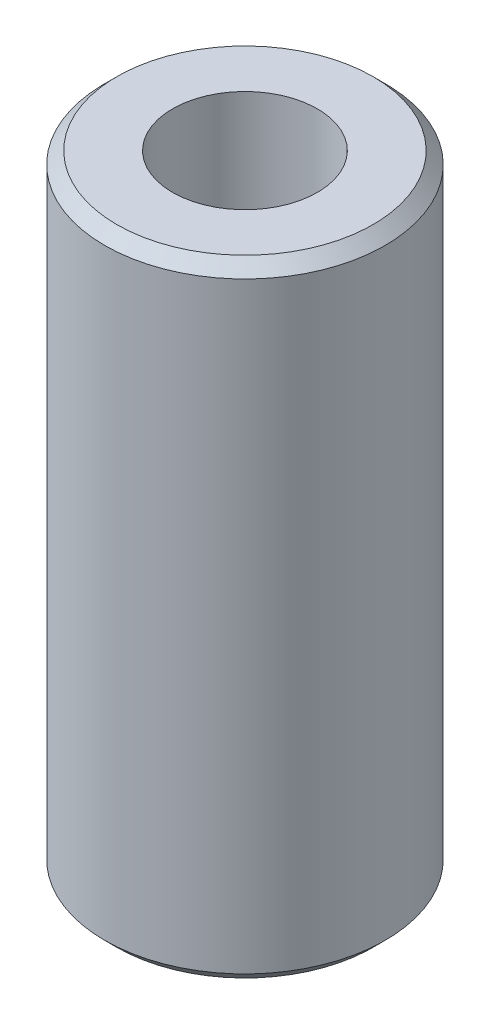
ISO-10303-21;
HEADER;
FILE_DESCRIPTION(('STEP AP214'),'2;1');
FILE_NAME('part.step','',(''),(''),'','','');
FILE_SCHEMA(('AUTOMOTIVE_DESIGN { 1 0 10303 214 1 1 1 1 }'));
ENDSEC;
DATA;
#1=APPLICATION_CONTEXT('core data for automotive mechanical design processes');
#2=APPLICATION_PROTOCOL_DEFINITION('international standard','automotive_design',2000,#1);
#3=PRODUCT_CONTEXT('',#1,'mechanical');
#4=PRODUCT('Part','Part','',(#3));
#5=PRODUCT_RELATED_PRODUCT_CATEGORY('part','',(#4));
#6=PRODUCT_DEFINITION_FORMATION('','',#4);
#7=PRODUCT_DEFINITION_CONTEXT('part definition',#1,'design');
#8=PRODUCT_DEFINITION('design','',#6,#7);
#9=PRODUCT_DEFINITION_SHAPE('','',#8);
#10=(LENGTH_UNIT() NAMED_UNIT(*) SI_UNIT(.MILLI.,.METRE.));
#11=(NAMED_UNIT(*) PLANE_ANGLE_UNIT() SI_UNIT($,.RADIAN.));
#12=(NAMED_UNIT(*) SI_UNIT($,.STERADIAN.) SOLID_ANGLE_UNIT());
#13=UNCERTAINTY_MEASURE_WITH_UNIT(LENGTH_MEASURE(1.E-05),#10,'distance_accuracy_value','');
#14=(GEOMETRIC_REPRESENTATION_CONTEXT(3) GLOBAL_UNCERTAINTY_ASSIGNED_CONTEXT((#13)) GLOBAL_UNIT_ASSIGNED_CONTEXT((#10,
#11,#12)) REPRESENTATION_CONTEXT('',''));
#15=CARTESIAN_POINT('',(0.,0.,0.));
#16=DIRECTION('',(0.,0.,1.));
#17=DIRECTION('',(1.,0.,0.));
#18=AXIS2_PLACEMENT_3D('',#15,#16,#17);
#19=CARTESIAN_POINT('',(0.,111.609927978686,0.));
#20=DIRECTION('',(0.,-1.,0.));
#21=DIRECTION('',(0.,0.,-1.));
#22=AXIS2_PLACEMENT_3D('',#19,#20,#21);
#23=CYLINDRICAL_SURFACE('',#22,25.);
#24=CARTESIAN_POINT('',(0.,109.460376625235,0.));
#25=DIRECTION('',(0.,1.,0.));
#26=DIRECTION('',(0.,0.,1.));
#27=AXIS2_PLACEMENT_3D('',#24,#25,#26);
#28=CIRCLE('',#27,25.);
#29=CARTESIAN_POINT('',(0.,109.460376625235,25.));
#30=VERTEX_POINT('',#29);
#31=EDGE_CURVE('E50',#30,#30,#28,.F.);
#32=ORIENTED_EDGE('',*,*,#31,.T.);
#33=EDGE_LOOP('',(#32));
#34=FACE_BOUND('',#33,.T.);
#35=CARTESIAN_POINT('',(0.,2.14955135345062,0.));
#36=DIRECTION('',(0.,1.,0.));
#37=DIRECTION('',(0.,0.,1.));
#38=AXIS2_PLACEMENT_3D('',#35,#36,#37);
#39=CIRCLE('',#38,25.);
#40=CARTESIAN_POINT('',(0.,2.14955135345062,25.));
#41=VERTEX_POINT('',#40);
#42=EDGE_CURVE('E51',#41,#41,#39,.T.);
#43=ORIENTED_EDGE('',*,*,#42,.T.);
#44=EDGE_LOOP('',(#43));
#45=FACE_BOUND('',#44,.T.);
#46=ADVANCED_FACE('F39',(#34,#45),#23,.T.);
#47=CARTESIAN_POINT('',(0.,111.609927978686,0.));
#48=DIRECTION('',(0.,1.,0.));
#49=DIRECTION('',(0.,0.,1.));
#50=AXIS2_PLACEMENT_3D('',#47,#48,#49);
#51=PLANE('',#50);
#52=CARTESIAN_POINT('',(0.,111.609927978686,0.));
#53=DIRECTION('',(0.,1.,0.));
#54=DIRECTION('',(0.,0.,1.));
#55=AXIS2_PLACEMENT_3D('',#52,#53,#54);
#56=CIRCLE('',#55,22.8504486465494);
#57=CARTESIAN_POINT('',(0.,111.609927978686,22.8504486465494));
#58=VERTEX_POINT('',#57);
#59=EDGE_CURVE('E54',#58,#58,#56,.T.);
#60=ORIENTED_EDGE('',*,*,#59,.T.);
#61=EDGE_LOOP('',(#60));
#62=FACE_BOUND('',#61,.T.);
#63=CARTESIAN_POINT('',(0.,111.609927978686,0.));
#64=DIRECTION('',(0.,1.,0.));
#65=DIRECTION('',(0.,0.,1.));
#66=AXIS2_PLACEMENT_3D('',#63,#64,#65);
#67=CIRCLE('',#66,12.9145364694436);
#68=CARTESIAN_POINT('',(0.,111.609927978686,12.9145364694436));
#69=VERTEX_POINT('',#68);
#70=EDGE_CURVE('E58',#69,#69,#67,.T.);
#71=ORIENTED_EDGE('',*,*,#70,.F.);
#72=EDGE_LOOP('',(#71));
#73=FACE_BOUND('',#72,.T.);
#74=ADVANCED_FACE('F69',(#62,#73),#51,.T.);
#75=CARTESIAN_POINT('',(0.,0.,0.));
#76=DIRECTION('',(0.,1.,0.));
#77=DIRECTION('',(0.,0.,1.));
#78=AXIS2_PLACEMENT_3D('',#75,#76,#77);
#79=PLANE('',#78);
#80=CARTESIAN_POINT('',(0.,0.,0.));
#81=DIRECTION('',(0.,1.,0.));
#82=DIRECTION('',(0.,0.,1.));
#83=AXIS2_PLACEMENT_3D('',#80,#81,#82);
#84=CIRCLE('',#83,22.8504486465494);
#85=CARTESIAN_POINT('',(0.,0.,22.8504486465494));
#86=VERTEX_POINT('',#85);
#87=EDGE_CURVE('E10',#86,#86,#84,.F.);
#88=ORIENTED_EDGE('',*,*,#87,.T.);
#89=EDGE_LOOP('',(#88));
#90=FACE_BOUND('',#89,.T.);
#91=CARTESIAN_POINT('',(0.,0.,0.));
#92=DIRECTION('',(0.,1.,0.));
#93=DIRECTION('',(0.,0.,1.));
#94=AXIS2_PLACEMENT_3D('',#91,#92,#93);
#95=CIRCLE('',#94,12.9145364694436);
#96=CARTESIAN_POINT('',(0.,0.,12.9145364694436));
#97=VERTEX_POINT('',#96);
#98=EDGE_CURVE('E63',#97,#97,#95,.T.);
#99=ORIENTED_EDGE('',*,*,#98,.T.);
#100=EDGE_LOOP('',(#99));
#101=FACE_BOUND('',#100,.T.);
#102=ADVANCED_FACE('F75',(#90,#101),#79,.F.);
#103=CARTESIAN_POINT('',(0.,111.609927978686,0.));
#104=DIRECTION('',(0.,-1.,0.));
#105=DIRECTION('',(0.,0.,-1.));
#106=AXIS2_PLACEMENT_3D('',#103,#104,#105);
#107=CYLINDRICAL_SURFACE('',#106,12.9145364694436);
#108=ORIENTED_EDGE('',*,*,#70,.T.);
#109=EDGE_LOOP('',(#108));
#110=FACE_BOUND('',#109,.T.);
#111=ORIENTED_EDGE('',*,*,#98,.F.);
#112=EDGE_LOOP('',(#111));
#113=FACE_BOUND('',#112,.T.);
#114=ADVANCED_FACE('F70',(#110,#113),#107,.F.);
#115=CARTESIAN_POINT('',(0.,111.609927978686,0.));
#116=DIRECTION('',(0.,-1.,0.));
#117=DIRECTION('',(0.,0.,-1.));
#118=AXIS2_PLACEMENT_3D('',#115,#116,#117);
#119=CONICAL_SURFACE('',#118,22.8504486465494,0.785398163397447);
#120=ORIENTED_EDGE('',*,*,#31,.F.);
#121=EDGE_LOOP('',(#120));
#122=FACE_BOUND('',#121,.T.);
#123=ORIENTED_EDGE('',*,*,#59,.F.);
#124=EDGE_LOOP('',(#123));
#125=FACE_BOUND('',#124,.T.);
#126=ADVANCED_FACE('F81',(#122,#125),#119,.T.);
#127=CARTESIAN_POINT('',(0.,2.14955135345062,0.));
#128=DIRECTION('',(0.,1.,0.));
#129=DIRECTION('',(0.,0.,1.));
#130=AXIS2_PLACEMENT_3D('',#127,#128,#129);
#131=CONICAL_SURFACE('',#130,25.,0.785398163397452);
#132=ORIENTED_EDGE('',*,*,#87,.F.);
#133=EDGE_LOOP('',(#132));
#134=FACE_BOUND('',#133,.T.);
#135=ORIENTED_EDGE('',*,*,#42,.F.);
#136=EDGE_LOOP('',(#135));
#137=FACE_BOUND('',#136,.T.);
#138=ADVANCED_FACE('F45',(#134,#137),#131,.T.);
#139=CLOSED_SHELL('',(#46,#74,#102,#114,#126,#138));
#140=MANIFOLD_SOLID_BREP('B2',#139);
#141=ADVANCED_BREP_SHAPE_REPRESENTATION('',(#18,#140),#14);
#142=SHAPE_DEFINITION_REPRESENTATION(#9,#141);
ENDSEC;
END-ISO-10303-21;
